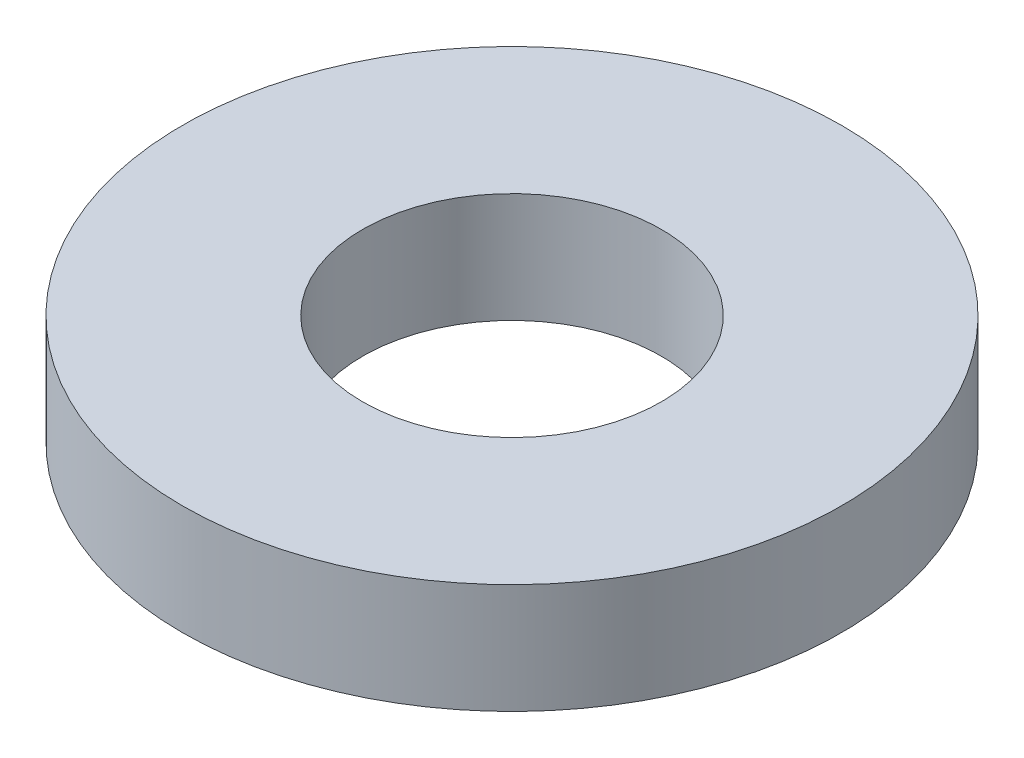
ISO-10303-21;
HEADER;
FILE_DESCRIPTION(('STEP AP214'),'2;1');
FILE_NAME('part.step','',(''),(''),'','','');
FILE_SCHEMA(('AUTOMOTIVE_DESIGN { 1 0 10303 214 1 1 1 1 }'));
ENDSEC;
DATA;
#1=APPLICATION_CONTEXT('core data for automotive mechanical design processes');
#2=APPLICATION_PROTOCOL_DEFINITION('international standard','automotive_design',2000,#1);
#3=PRODUCT_CONTEXT('',#1,'mechanical');
#4=PRODUCT('Part','Part','',(#3));
#5=PRODUCT_RELATED_PRODUCT_CATEGORY('part','',(#4));
#6=PRODUCT_DEFINITION_FORMATION('','',#4);
#7=PRODUCT_DEFINITION_CONTEXT('part definition',#1,'design');
#8=PRODUCT_DEFINITION('design','',#6,#7);
#9=PRODUCT_DEFINITION_SHAPE('','',#8);
#10=(LENGTH_UNIT() NAMED_UNIT(*) SI_UNIT(.MILLI.,.METRE.));
#11=(NAMED_UNIT(*) PLANE_ANGLE_UNIT() SI_UNIT($,.RADIAN.));
#12=(NAMED_UNIT(*) SI_UNIT($,.STERADIAN.) SOLID_ANGLE_UNIT());
#13=UNCERTAINTY_MEASURE_WITH_UNIT(LENGTH_MEASURE(1.E-05),#10,'distance_accuracy_value','');
#14=(GEOMETRIC_REPRESENTATION_CONTEXT(3) GLOBAL_UNCERTAINTY_ASSIGNED_CONTEXT((#13)) GLOBAL_UNIT_ASSIGNED_CONTEXT((#10,
#11,#12)) REPRESENTATION_CONTEXT('',''));
#15=CARTESIAN_POINT('',(0.,0.,0.));
#16=DIRECTION('',(0.,0.,1.));
#17=DIRECTION('',(1.,0.,0.));
#18=AXIS2_PLACEMENT_3D('',#15,#16,#17);
#19=CARTESIAN_POINT('',(0.,1.5875,0.));
#20=DIRECTION('',(0.,1.,0.));
#21=DIRECTION('',(0.,0.,1.));
#22=AXIS2_PLACEMENT_3D('',#19,#20,#21);
#23=PLANE('',#22);
#24=CARTESIAN_POINT('',(0.,1.5875,0.));
#25=DIRECTION('',(0.,1.,0.));
#26=DIRECTION('',(0.,0.,1.));
#27=AXIS2_PLACEMENT_3D('',#24,#25,#26);
#28=CIRCLE('',#27,4.7625);
#29=CARTESIAN_POINT('',(0.,1.5875,4.7625));
#30=VERTEX_POINT('',#29);
#31=EDGE_CURVE('E10',#30,#30,#28,.T.);
#32=ORIENTED_EDGE('',*,*,#31,.T.);
#33=EDGE_LOOP('',(#32));
#34=FACE_BOUND('',#33,.T.);
#35=CARTESIAN_POINT('',(0.,1.5875,0.));
#36=DIRECTION('',(0.,1.,0.));
#37=DIRECTION('',(0.,0.,1.));
#38=AXIS2_PLACEMENT_3D('',#35,#36,#37);
#39=CIRCLE('',#38,2.159);
#40=CARTESIAN_POINT('',(0.,1.5875,2.159));
#41=VERTEX_POINT('',#40);
#42=EDGE_CURVE('E42',#41,#41,#39,.T.);
#43=ORIENTED_EDGE('',*,*,#42,.F.);
#44=EDGE_LOOP('',(#43));
#45=FACE_BOUND('',#44,.T.);
#46=ADVANCED_FACE('F31',(#34,#45),#23,.T.);
#47=CARTESIAN_POINT('',(0.,0.,0.));
#48=DIRECTION('',(0.,1.,0.));
#49=DIRECTION('',(0.,0.,1.));
#50=AXIS2_PLACEMENT_3D('',#47,#48,#49);
#51=PLANE('',#50);
#52=CARTESIAN_POINT('',(0.,0.,0.));
#53=DIRECTION('',(0.,1.,0.));
#54=DIRECTION('',(0.,0.,1.));
#55=AXIS2_PLACEMENT_3D('',#52,#53,#54);
#56=CIRCLE('',#55,4.7625);
#57=CARTESIAN_POINT('',(0.,0.,4.7625));
#58=VERTEX_POINT('',#57);
#59=EDGE_CURVE('E35',#58,#58,#56,.T.);
#60=ORIENTED_EDGE('',*,*,#59,.F.);
#61=EDGE_LOOP('',(#60));
#62=FACE_BOUND('',#61,.T.);
#63=CARTESIAN_POINT('',(0.,0.,0.));
#64=DIRECTION('',(0.,1.,0.));
#65=DIRECTION('',(0.,0.,1.));
#66=AXIS2_PLACEMENT_3D('',#63,#64,#65);
#67=CIRCLE('',#66,2.159);
#68=CARTESIAN_POINT('',(0.,0.,2.159));
#69=VERTEX_POINT('',#68);
#70=EDGE_CURVE('E44',#69,#69,#67,.T.);
#71=ORIENTED_EDGE('',*,*,#70,.T.);
#72=EDGE_LOOP('',(#71));
#73=FACE_BOUND('',#72,.T.);
#74=ADVANCED_FACE('F54',(#62,#73),#51,.F.);
#75=CARTESIAN_POINT('',(0.,1.5875,0.));
#76=DIRECTION('',(0.,-1.,0.));
#77=DIRECTION('',(0.,0.,-1.));
#78=AXIS2_PLACEMENT_3D('',#75,#76,#77);
#79=CYLINDRICAL_SURFACE('',#78,4.7625);
#80=ORIENTED_EDGE('',*,*,#31,.F.);
#81=EDGE_LOOP('',(#80));
#82=FACE_BOUND('',#81,.T.);
#83=ORIENTED_EDGE('',*,*,#59,.T.);
#84=EDGE_LOOP('',(#83));
#85=FACE_BOUND('',#84,.T.);
#86=ADVANCED_FACE('F33',(#82,#85),#79,.T.);
#87=CARTESIAN_POINT('',(0.,1.5875,0.));
#88=DIRECTION('',(0.,-1.,0.));
#89=DIRECTION('',(0.,0.,-1.));
#90=AXIS2_PLACEMENT_3D('',#87,#88,#89);
#91=CYLINDRICAL_SURFACE('',#90,2.159);
#92=ORIENTED_EDGE('',*,*,#42,.T.);
#93=EDGE_LOOP('',(#92));
#94=FACE_BOUND('',#93,.T.);
#95=ORIENTED_EDGE('',*,*,#70,.F.);
#96=EDGE_LOOP('',(#95));
#97=FACE_BOUND('',#96,.T.);
#98=ADVANCED_FACE('F50',(#94,#97),#91,.F.);
#99=CLOSED_SHELL('',(#46,#74,#86,#98));
#100=MANIFOLD_SOLID_BREP('B2',#99);
#101=ADVANCED_BREP_SHAPE_REPRESENTATION('',(#18,#100),#14);
#102=SHAPE_DEFINITION_REPRESENTATION(#9,#101);
ENDSEC;
END-ISO-10303-21;
